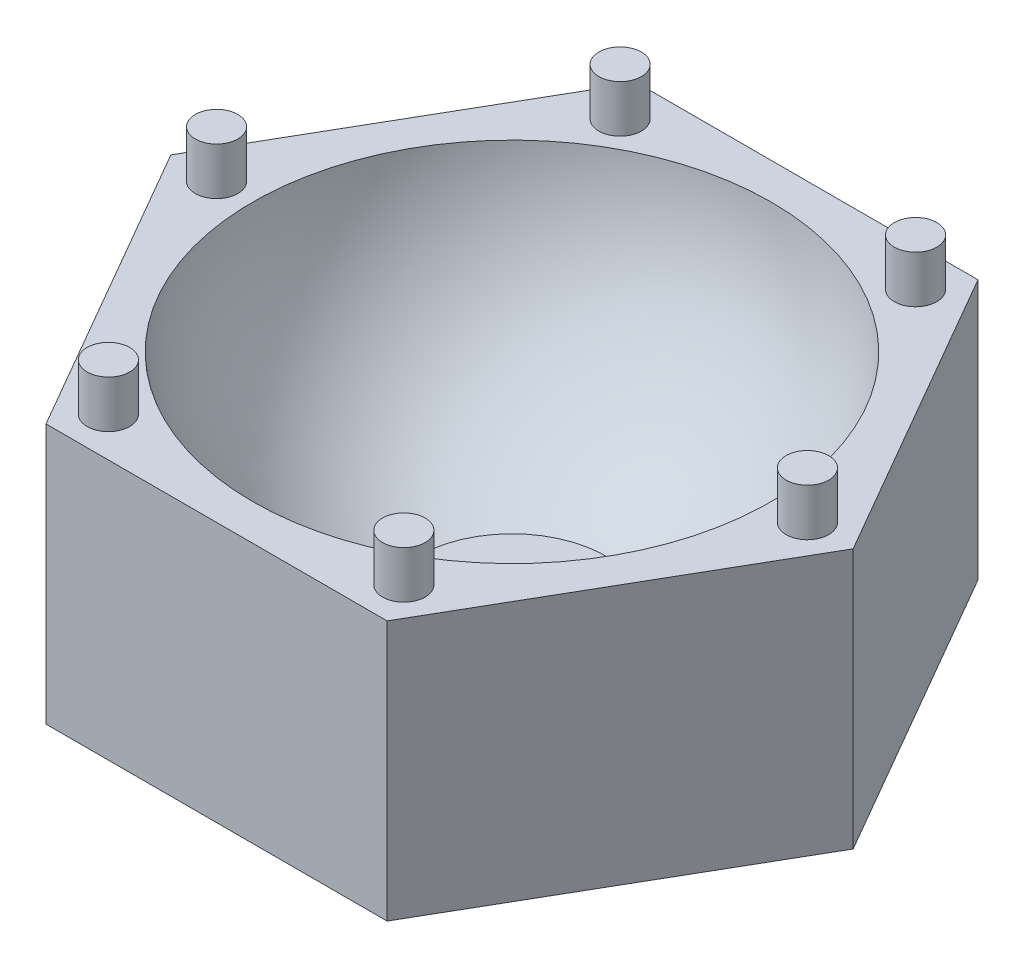
ISO-10303-21;
HEADER;
FILE_DESCRIPTION(('STEP AP214'),'2;1');
FILE_NAME('part.step','',(''),(''),'','','');
FILE_SCHEMA(('AUTOMOTIVE_DESIGN { 1 0 10303 214 1 1 1 1 }'));
ENDSEC;
DATA;
#1=APPLICATION_CONTEXT('core data for automotive mechanical design processes');
#2=APPLICATION_PROTOCOL_DEFINITION('international standard','automotive_design',2000,#1);
#3=PRODUCT_CONTEXT('',#1,'mechanical');
#4=PRODUCT('Part','Part','',(#3));
#5=PRODUCT_RELATED_PRODUCT_CATEGORY('part','',(#4));
#6=PRODUCT_DEFINITION_FORMATION('','',#4);
#7=PRODUCT_DEFINITION_CONTEXT('part definition',#1,'design');
#8=PRODUCT_DEFINITION('design','',#6,#7);
#9=PRODUCT_DEFINITION_SHAPE('','',#8);
#10=(LENGTH_UNIT() NAMED_UNIT(*) SI_UNIT(.MILLI.,.METRE.));
#11=(NAMED_UNIT(*) PLANE_ANGLE_UNIT() SI_UNIT($,.RADIAN.));
#12=(NAMED_UNIT(*) SI_UNIT($,.STERADIAN.) SOLID_ANGLE_UNIT());
#13=UNCERTAINTY_MEASURE_WITH_UNIT(LENGTH_MEASURE(1.E-05),#10,'distance_accuracy_value','');
#14=(GEOMETRIC_REPRESENTATION_CONTEXT(3) GLOBAL_UNCERTAINTY_ASSIGNED_CONTEXT((#13)) GLOBAL_UNIT_ASSIGNED_CONTEXT((#10,
#11,#12)) REPRESENTATION_CONTEXT('',''));
#15=CARTESIAN_POINT('',(0.,0.,0.));
#16=DIRECTION('',(0.,0.,1.));
#17=DIRECTION('',(1.,0.,0.));
#18=AXIS2_PLACEMENT_3D('',#15,#16,#17);
#19=CARTESIAN_POINT('',(0.,55.,0.));
#20=DIRECTION('',(0.,1.,0.));
#21=DIRECTION('',(0.,0.,1.));
#22=AXIS2_PLACEMENT_3D('',#19,#20,#21);
#23=PLANE('',#22);
#24=CARTESIAN_POINT('',(31.25,55.,-54.1265877365274));
#25=DIRECTION('',(0.,1.,0.));
#26=DIRECTION('',(0.,0.,1.));
#27=AXIS2_PLACEMENT_3D('',#24,#25,#26);
#28=CIRCLE('',#27,4.50000000000001);
#29=CARTESIAN_POINT('',(31.25,55.,-49.6265877365274));
#30=VERTEX_POINT('',#29);
#31=EDGE_CURVE('E236',#30,#30,#28,.T.);
#32=ORIENTED_EDGE('',*,*,#31,.F.);
#33=EDGE_LOOP('',(#32));
#34=FACE_BOUND('',#33,.T.);
#35=CARTESIAN_POINT('',(-31.25,55.,-54.1265877365274));
#36=DIRECTION('',(0.,1.,0.));
#37=DIRECTION('',(0.,0.,1.));
#38=AXIS2_PLACEMENT_3D('',#35,#36,#37);
#39=CIRCLE('',#38,4.50000000000001);
#40=CARTESIAN_POINT('',(-31.25,55.,-49.6265877365274));
#41=VERTEX_POINT('',#40);
#42=EDGE_CURVE('E235',#41,#41,#39,.T.);
#43=ORIENTED_EDGE('',*,*,#42,.F.);
#44=EDGE_LOOP('',(#43));
#45=FACE_BOUND('',#44,.T.);
#46=CARTESIAN_POINT('',(-62.5,55.,0.));
#47=DIRECTION('',(0.,1.,0.));
#48=DIRECTION('',(0.,0.,1.));
#49=AXIS2_PLACEMENT_3D('',#46,#47,#48);
#50=CIRCLE('',#49,4.50000000000001);
#51=CARTESIAN_POINT('',(-62.5,55.,4.50000000000002));
#52=VERTEX_POINT('',#51);
#53=EDGE_CURVE('E245',#52,#52,#50,.T.);
#54=ORIENTED_EDGE('',*,*,#53,.F.);
#55=EDGE_LOOP('',(#54));
#56=FACE_BOUND('',#55,.T.);
#57=CARTESIAN_POINT('',(-31.25,55.,54.1265877365274));
#58=DIRECTION('',(0.,1.,0.));
#59=DIRECTION('',(0.,0.,1.));
#60=AXIS2_PLACEMENT_3D('',#57,#58,#59);
#61=CIRCLE('',#60,4.50000000000002);
#62=CARTESIAN_POINT('',(-31.25,55.,58.6265877365274));
#63=VERTEX_POINT('',#62);
#64=EDGE_CURVE('E250',#63,#63,#61,.T.);
#65=ORIENTED_EDGE('',*,*,#64,.F.);
#66=EDGE_LOOP('',(#65));
#67=FACE_BOUND('',#66,.T.);
#68=CARTESIAN_POINT('',(31.25,55.,54.1265877365274));
#69=DIRECTION('',(0.,1.,0.));
#70=DIRECTION('',(0.,0.,1.));
#71=AXIS2_PLACEMENT_3D('',#68,#69,#70);
#72=CIRCLE('',#71,4.50000000000001);
#73=CARTESIAN_POINT('',(31.25,55.,58.6265877365274));
#74=VERTEX_POINT('',#73);
#75=EDGE_CURVE('E256',#74,#74,#72,.T.);
#76=ORIENTED_EDGE('',*,*,#75,.F.);
#77=EDGE_LOOP('',(#76));
#78=FACE_BOUND('',#77,.T.);
#79=CARTESIAN_POINT('',(62.5,55.,0.));
#80=DIRECTION('',(0.,1.,0.));
#81=DIRECTION('',(0.,0.,1.));
#82=AXIS2_PLACEMENT_3D('',#79,#80,#81);
#83=CIRCLE('',#82,4.5);
#84=CARTESIAN_POINT('',(62.5,55.,4.5));
#85=VERTEX_POINT('',#84);
#86=EDGE_CURVE('E119',#85,#85,#83,.T.);
#87=ORIENTED_EDGE('',*,*,#86,.F.);
#88=EDGE_LOOP('',(#87));
#89=FACE_BOUND('',#88,.T.);
#90=DIRECTION('',(1.,0.,0.));
#91=VECTOR('',#90,1.);
#92=CARTESIAN_POINT('',(-36.0843918243516,55.,62.5));
#93=LINE('',#92,#91);
#94=CARTESIAN_POINT('',(-36.0843918243516,55.,62.5));
#95=VERTEX_POINT('',#94);
#96=CARTESIAN_POINT('',(36.0843918243516,55.,62.5));
#97=VERTEX_POINT('',#96);
#98=EDGE_CURVE('E94',#95,#97,#93,.T.);
#99=ORIENTED_EDGE('',*,*,#98,.T.);
#100=DIRECTION('',(0.499999999999999,0.,-0.866025403784439));
#101=VECTOR('',#100,1.);
#102=CARTESIAN_POINT('',(36.0843918243516,55.,62.5));
#103=LINE('',#102,#101);
#104=CARTESIAN_POINT('',(72.1687836487032,55.,0.));
#105=VERTEX_POINT('',#104);
#106=EDGE_CURVE('E102',#97,#105,#103,.T.);
#107=ORIENTED_EDGE('',*,*,#106,.T.);
#108=DIRECTION('',(-0.5,0.,-0.866025403784438));
#109=VECTOR('',#108,1.);
#110=CARTESIAN_POINT('',(72.1687836487032,55.,0.));
#111=LINE('',#110,#109);
#112=CARTESIAN_POINT('',(36.0843918243516,55.,-62.5));
#113=VERTEX_POINT('',#112);
#114=EDGE_CURVE('E107',#105,#113,#111,.T.);
#115=ORIENTED_EDGE('',*,*,#114,.T.);
#116=DIRECTION('',(-1.,0.,0.));
#117=VECTOR('',#116,1.);
#118=CARTESIAN_POINT('',(36.0843918243516,55.,-62.5));
#119=LINE('',#118,#117);
#120=CARTESIAN_POINT('',(-36.0843918243516,55.,-62.5));
#121=VERTEX_POINT('',#120);
#122=EDGE_CURVE('E151',#113,#121,#119,.T.);
#123=ORIENTED_EDGE('',*,*,#122,.T.);
#124=DIRECTION('',(-0.499999999999999,0.,0.866025403784439));
#125=VECTOR('',#124,1.);
#126=CARTESIAN_POINT('',(-36.0843918243516,55.,-62.5));
#127=LINE('',#126,#125);
#128=CARTESIAN_POINT('',(-72.1687836487032,55.,0.));
#129=VERTEX_POINT('',#128);
#130=EDGE_CURVE('E116',#121,#129,#127,.T.);
#131=ORIENTED_EDGE('',*,*,#130,.T.);
#132=DIRECTION('',(0.5,0.,0.866025403784439));
#133=VECTOR('',#132,1.);
#134=CARTESIAN_POINT('',(-72.1687836487032,55.,0.));
#135=LINE('',#134,#133);
#136=EDGE_CURVE('E113',#129,#95,#135,.T.);
#137=ORIENTED_EDGE('',*,*,#136,.T.);
#138=EDGE_LOOP('',(#99,#107,#115,#123,#131,#137));
#139=FACE_BOUND('',#138,.T.);
#140=CARTESIAN_POINT('',(0.,55.,0.));
#141=DIRECTION('',(0.,1.,0.));
#142=DIRECTION('',(0.,0.,1.));
#143=AXIS2_PLACEMENT_3D('',#140,#141,#142);
#144=CIRCLE('',#143,54.8709661048334);
#145=CARTESIAN_POINT('',(0.,55.,54.8709661048334));
#146=VERTEX_POINT('',#145);
#147=EDGE_CURVE('E106',#146,#146,#144,.T.);
#148=ORIENTED_EDGE('',*,*,#147,.F.);
#149=EDGE_LOOP('',(#148));
#150=FACE_BOUND('',#149,.T.);
#151=ADVANCED_FACE('F36',(#34,#45,#56,#67,#78,#89,#139,#150),#23,.T.);
#152=CARTESIAN_POINT('',(0.,7.53049234040404,0.));
#153=DIRECTION('',(0.,1.,0.));
#154=DIRECTION('',(0.,0.,1.));
#155=AXIS2_PLACEMENT_3D('',#152,#153,#154);
#156=PLANE('',#155);
#157=CARTESIAN_POINT('',(0.,7.53049234040402,0.));
#158=DIRECTION('',(0.,1.,0.));
#159=DIRECTION('',(0.,0.,1.));
#160=AXIS2_PLACEMENT_3D('',#157,#158,#159);
#161=CIRCLE('',#160,20.);
#162=CARTESIAN_POINT('',(0.,7.53049234040402,20.));
#163=VERTEX_POINT('',#162);
#164=EDGE_CURVE('E11',#163,#163,#161,.T.);
#165=ORIENTED_EDGE('',*,*,#164,.T.);
#166=EDGE_LOOP('',(#165));
#167=FACE_BOUND('',#166,.T.);
#168=ADVANCED_FACE('F167',(#167),#156,.T.);
#169=CARTESIAN_POINT('',(0.,58.765246170202,0.));
#170=DIRECTION('',(0.,1.,0.));
#171=DIRECTION('',(0.,0.,-1.));
#172=AXIS2_PLACEMENT_3D('',#169,#170,#171);
#173=SPHERICAL_SURFACE('',#172,55.);
#174=ORIENTED_EDGE('',*,*,#164,.F.);
#175=EDGE_LOOP('',(#174));
#176=FACE_BOUND('',#175,.T.);
#177=ORIENTED_EDGE('',*,*,#147,.T.);
#178=EDGE_LOOP('',(#177));
#179=FACE_BOUND('',#178,.T.);
#180=ADVANCED_FACE('F169',(#176,#179),#173,.F.);
#181=CARTESIAN_POINT('',(36.0843918243516,110.,62.5));
#182=DIRECTION('',(-0.866025403784439,0.,-0.499999999999999));
#183=DIRECTION('',(-0.499999999999999,0.,0.866025403784439));
#184=AXIS2_PLACEMENT_3D('',#181,#182,#183);
#185=PLANE('',#184);
#186=ORIENTED_EDGE('',*,*,#106,.F.);
#187=DIRECTION('',(0.,-1.,0.));
#188=VECTOR('',#187,1.);
#189=CARTESIAN_POINT('',(36.0843918243516,110.,62.5));
#190=LINE('',#189,#188);
#191=CARTESIAN_POINT('',(36.0843918243516,0.,62.5));
#192=VERTEX_POINT('',#191);
#193=EDGE_CURVE('E40',#97,#192,#190,.T.);
#194=ORIENTED_EDGE('',*,*,#193,.T.);
#195=DIRECTION('',(0.499999999999999,0.,-0.866025403784439));
#196=VECTOR('',#195,1.);
#197=CARTESIAN_POINT('',(36.0843918243516,0.,62.5));
#198=LINE('',#197,#196);
#199=CARTESIAN_POINT('',(72.1687836487032,0.,0.));
#200=VERTEX_POINT('',#199);
#201=EDGE_CURVE('E45',#192,#200,#198,.T.);
#202=ORIENTED_EDGE('',*,*,#201,.T.);
#203=DIRECTION('',(0.,-1.,0.));
#204=VECTOR('',#203,1.);
#205=CARTESIAN_POINT('',(72.1687836487032,110.,0.));
#206=LINE('',#205,#204);
#207=EDGE_CURVE('E53',#105,#200,#206,.T.);
#208=ORIENTED_EDGE('',*,*,#207,.F.);
#209=EDGE_LOOP('',(#186,#194,#202,#208));
#210=FACE_BOUND('',#209,.T.);
#211=ADVANCED_FACE('F103',(#210),#185,.F.);
#212=CARTESIAN_POINT('',(72.1687836487032,110.,0.));
#213=DIRECTION('',(-0.866025403784438,0.,0.5));
#214=DIRECTION('',(0.5,0.,0.866025403784438));
#215=AXIS2_PLACEMENT_3D('',#212,#213,#214);
#216=PLANE('',#215);
#217=ORIENTED_EDGE('',*,*,#114,.F.);
#218=ORIENTED_EDGE('',*,*,#207,.T.);
#219=DIRECTION('',(-0.5,0.,-0.866025403784438));
#220=VECTOR('',#219,1.);
#221=CARTESIAN_POINT('',(72.1687836487032,0.,0.));
#222=LINE('',#221,#220);
#223=CARTESIAN_POINT('',(36.0843918243516,0.,-62.5));
#224=VERTEX_POINT('',#223);
#225=EDGE_CURVE('E145',#200,#224,#222,.T.);
#226=ORIENTED_EDGE('',*,*,#225,.T.);
#227=DIRECTION('',(0.,-1.,0.));
#228=VECTOR('',#227,1.);
#229=CARTESIAN_POINT('',(36.0843918243516,110.,-62.5));
#230=LINE('',#229,#228);
#231=EDGE_CURVE('E61',#113,#224,#230,.T.);
#232=ORIENTED_EDGE('',*,*,#231,.F.);
#233=EDGE_LOOP('',(#217,#218,#226,#232));
#234=FACE_BOUND('',#233,.T.);
#235=ADVANCED_FACE('F159',(#234),#216,.F.);
#236=CARTESIAN_POINT('',(36.0843918243516,110.,-62.5));
#237=DIRECTION('',(0.,0.,1.));
#238=DIRECTION('',(1.,0.,0.));
#239=AXIS2_PLACEMENT_3D('',#236,#237,#238);
#240=PLANE('',#239);
#241=ORIENTED_EDGE('',*,*,#122,.F.);
#242=ORIENTED_EDGE('',*,*,#231,.T.);
#243=DIRECTION('',(-1.,0.,0.));
#244=VECTOR('',#243,1.);
#245=CARTESIAN_POINT('',(36.0843918243516,0.,-62.5));
#246=LINE('',#245,#244);
#247=CARTESIAN_POINT('',(-36.0843918243516,0.,-62.5));
#248=VERTEX_POINT('',#247);
#249=EDGE_CURVE('E143',#224,#248,#246,.T.);
#250=ORIENTED_EDGE('',*,*,#249,.T.);
#251=DIRECTION('',(0.,-1.,0.));
#252=VECTOR('',#251,1.);
#253=CARTESIAN_POINT('',(-36.0843918243516,110.,-62.5));
#254=LINE('',#253,#252);
#255=EDGE_CURVE('E125',#121,#248,#254,.T.);
#256=ORIENTED_EDGE('',*,*,#255,.F.);
#257=EDGE_LOOP('',(#241,#242,#250,#256));
#258=FACE_BOUND('',#257,.T.);
#259=ADVANCED_FACE('F157',(#258),#240,.F.);
#260=CARTESIAN_POINT('',(-36.0843918243516,110.,-62.5));
#261=DIRECTION('',(0.866025403784439,0.,0.499999999999999));
#262=DIRECTION('',(0.499999999999999,0.,-0.866025403784439));
#263=AXIS2_PLACEMENT_3D('',#260,#261,#262);
#264=PLANE('',#263);
#265=ORIENTED_EDGE('',*,*,#130,.F.);
#266=ORIENTED_EDGE('',*,*,#255,.T.);
#267=DIRECTION('',(-0.499999999999999,0.,0.866025403784439));
#268=VECTOR('',#267,1.);
#269=CARTESIAN_POINT('',(-36.0843918243516,0.,-62.5));
#270=LINE('',#269,#268);
#271=CARTESIAN_POINT('',(-72.1687836487032,0.,0.));
#272=VERTEX_POINT('',#271);
#273=EDGE_CURVE('E136',#248,#272,#270,.T.);
#274=ORIENTED_EDGE('',*,*,#273,.T.);
#275=DIRECTION('',(0.,-1.,0.));
#276=VECTOR('',#275,1.);
#277=CARTESIAN_POINT('',(-72.1687836487032,110.,0.));
#278=LINE('',#277,#276);
#279=EDGE_CURVE('E127',#129,#272,#278,.T.);
#280=ORIENTED_EDGE('',*,*,#279,.F.);
#281=EDGE_LOOP('',(#265,#266,#274,#280));
#282=FACE_BOUND('',#281,.T.);
#283=ADVANCED_FACE('F155',(#282),#264,.F.);
#284=CARTESIAN_POINT('',(-72.1687836487032,110.,0.));
#285=DIRECTION('',(0.866025403784439,0.,-0.5));
#286=DIRECTION('',(-0.5,0.,-0.866025403784439));
#287=AXIS2_PLACEMENT_3D('',#284,#285,#286);
#288=PLANE('',#287);
#289=ORIENTED_EDGE('',*,*,#136,.F.);
#290=ORIENTED_EDGE('',*,*,#279,.T.);
#291=DIRECTION('',(0.5,0.,0.866025403784438));
#292=VECTOR('',#291,1.);
#293=CARTESIAN_POINT('',(-72.1687836487032,0.,0.));
#294=LINE('',#293,#292);
#295=CARTESIAN_POINT('',(-36.0843918243516,0.,62.5));
#296=VERTEX_POINT('',#295);
#297=EDGE_CURVE('E131',#272,#296,#294,.T.);
#298=ORIENTED_EDGE('',*,*,#297,.T.);
#299=DIRECTION('',(0.,-1.,0.));
#300=VECTOR('',#299,1.);
#301=CARTESIAN_POINT('',(-36.0843918243516,110.,62.5));
#302=LINE('',#301,#300);
#303=EDGE_CURVE('E100',#95,#296,#302,.T.);
#304=ORIENTED_EDGE('',*,*,#303,.F.);
#305=EDGE_LOOP('',(#289,#290,#298,#304));
#306=FACE_BOUND('',#305,.T.);
#307=ADVANCED_FACE('F132',(#306),#288,.F.);
#308=CARTESIAN_POINT('',(-36.0843918243516,110.,62.5));
#309=DIRECTION('',(0.,0.,-1.));
#310=DIRECTION('',(-1.,0.,0.));
#311=AXIS2_PLACEMENT_3D('',#308,#309,#310);
#312=PLANE('',#311);
#313=ORIENTED_EDGE('',*,*,#98,.F.);
#314=ORIENTED_EDGE('',*,*,#303,.T.);
#315=DIRECTION('',(1.,0.,0.));
#316=VECTOR('',#315,1.);
#317=CARTESIAN_POINT('',(-36.0843918243516,0.,62.5));
#318=LINE('',#317,#316);
#319=EDGE_CURVE('E96',#296,#192,#318,.T.);
#320=ORIENTED_EDGE('',*,*,#319,.T.);
#321=ORIENTED_EDGE('',*,*,#193,.F.);
#322=EDGE_LOOP('',(#313,#314,#320,#321));
#323=FACE_BOUND('',#322,.T.);
#324=ADVANCED_FACE('F38',(#323),#312,.F.);
#325=CARTESIAN_POINT('',(0.,0.,0.));
#326=DIRECTION('',(0.,1.,0.));
#327=DIRECTION('',(0.,0.,1.));
#328=AXIS2_PLACEMENT_3D('',#325,#326,#327);
#329=PLANE('',#328);
#330=ORIENTED_EDGE('',*,*,#201,.F.);
#331=ORIENTED_EDGE('',*,*,#319,.F.);
#332=ORIENTED_EDGE('',*,*,#297,.F.);
#333=ORIENTED_EDGE('',*,*,#273,.F.);
#334=ORIENTED_EDGE('',*,*,#249,.F.);
#335=ORIENTED_EDGE('',*,*,#225,.F.);
#336=EDGE_LOOP('',(#330,#331,#332,#333,#334,#335));
#337=FACE_BOUND('',#336,.T.);
#338=ADVANCED_FACE('F138',(#337),#329,.F.);
#339=CARTESIAN_POINT('',(62.5,65.,0.));
#340=DIRECTION('',(0.,-1.,0.));
#341=DIRECTION('',(0.,0.,-1.));
#342=AXIS2_PLACEMENT_3D('',#339,#340,#341);
#343=CYLINDRICAL_SURFACE('',#342,4.5);
#344=CARTESIAN_POINT('',(62.5,65.,0.));
#345=DIRECTION('',(0.,1.,0.));
#346=DIRECTION('',(0.,0.,1.));
#347=AXIS2_PLACEMENT_3D('',#344,#345,#346);
#348=CIRCLE('',#347,4.5);
#349=CARTESIAN_POINT('',(62.5,65.,4.5));
#350=VERTEX_POINT('',#349);
#351=EDGE_CURVE('E114',#350,#350,#348,.T.);
#352=ORIENTED_EDGE('',*,*,#351,.F.);
#353=EDGE_LOOP('',(#352));
#354=FACE_BOUND('',#353,.T.);
#355=ORIENTED_EDGE('',*,*,#86,.T.);
#356=EDGE_LOOP('',(#355));
#357=FACE_BOUND('',#356,.T.);
#358=ADVANCED_FACE('F180',(#354,#357),#343,.T.);
#359=CARTESIAN_POINT('',(62.5,65.,0.));
#360=DIRECTION('',(0.,1.,0.));
#361=DIRECTION('',(0.,0.,1.));
#362=AXIS2_PLACEMENT_3D('',#359,#360,#361);
#363=PLANE('',#362);
#364=ORIENTED_EDGE('',*,*,#351,.T.);
#365=EDGE_LOOP('',(#364));
#366=FACE_BOUND('',#365,.T.);
#367=ADVANCED_FACE('F186',(#366),#363,.T.);
#368=CARTESIAN_POINT('',(31.25,65.,54.1265877365274));
#369=DIRECTION('',(0.,-1.,0.));
#370=DIRECTION('',(0.,0.,-1.));
#371=AXIS2_PLACEMENT_3D('',#368,#369,#370);
#372=CYLINDRICAL_SURFACE('',#371,4.50000000000001);
#373=CARTESIAN_POINT('',(31.25,65.,54.1265877365274));
#374=DIRECTION('',(0.,1.,0.));
#375=DIRECTION('',(0.,0.,1.));
#376=AXIS2_PLACEMENT_3D('',#373,#374,#375);
#377=CIRCLE('',#376,4.50000000000001);
#378=CARTESIAN_POINT('',(31.25,65.,58.6265877365274));
#379=VERTEX_POINT('',#378);
#380=EDGE_CURVE('E259',#379,#379,#377,.T.);
#381=ORIENTED_EDGE('',*,*,#380,.F.);
#382=EDGE_LOOP('',(#381));
#383=FACE_BOUND('',#382,.T.);
#384=ORIENTED_EDGE('',*,*,#75,.T.);
#385=EDGE_LOOP('',(#384));
#386=FACE_BOUND('',#385,.T.);
#387=ADVANCED_FACE('F190',(#383,#386),#372,.T.);
#388=CARTESIAN_POINT('',(31.25,65.,54.1265877365274));
#389=DIRECTION('',(0.,1.,0.));
#390=DIRECTION('',(0.,0.,1.));
#391=AXIS2_PLACEMENT_3D('',#388,#389,#390);
#392=PLANE('',#391);
#393=ORIENTED_EDGE('',*,*,#380,.T.);
#394=EDGE_LOOP('',(#393));
#395=FACE_BOUND('',#394,.T.);
#396=ADVANCED_FACE('F194',(#395),#392,.T.);
#397=CARTESIAN_POINT('',(-31.25,65.,54.1265877365274));
#398=DIRECTION('',(0.,-1.,0.));
#399=DIRECTION('',(0.,0.,-1.));
#400=AXIS2_PLACEMENT_3D('',#397,#398,#399);
#401=CYLINDRICAL_SURFACE('',#400,4.50000000000002);
#402=CARTESIAN_POINT('',(-31.25,65.,54.1265877365274));
#403=DIRECTION('',(0.,1.,0.));
#404=DIRECTION('',(0.,0.,1.));
#405=AXIS2_PLACEMENT_3D('',#402,#403,#404);
#406=CIRCLE('',#405,4.50000000000002);
#407=CARTESIAN_POINT('',(-31.25,65.,58.6265877365274));
#408=VERTEX_POINT('',#407);
#409=EDGE_CURVE('E253',#408,#408,#406,.T.);
#410=ORIENTED_EDGE('',*,*,#409,.F.);
#411=EDGE_LOOP('',(#410));
#412=FACE_BOUND('',#411,.T.);
#413=ORIENTED_EDGE('',*,*,#64,.T.);
#414=EDGE_LOOP('',(#413));
#415=FACE_BOUND('',#414,.T.);
#416=ADVANCED_FACE('F198',(#412,#415),#401,.T.);
#417=CARTESIAN_POINT('',(-31.25,65.,54.1265877365274));
#418=DIRECTION('',(0.,1.,0.));
#419=DIRECTION('',(0.,0.,1.));
#420=AXIS2_PLACEMENT_3D('',#417,#418,#419);
#421=PLANE('',#420);
#422=ORIENTED_EDGE('',*,*,#409,.T.);
#423=EDGE_LOOP('',(#422));
#424=FACE_BOUND('',#423,.T.);
#425=ADVANCED_FACE('F202',(#424),#421,.T.);
#426=CARTESIAN_POINT('',(-62.5,65.,0.));
#427=DIRECTION('',(0.,-1.,0.));
#428=DIRECTION('',(0.,0.,-1.));
#429=AXIS2_PLACEMENT_3D('',#426,#427,#428);
#430=CYLINDRICAL_SURFACE('',#429,4.50000000000001);
#431=CARTESIAN_POINT('',(-62.5,65.,0.));
#432=DIRECTION('',(0.,1.,0.));
#433=DIRECTION('',(0.,0.,1.));
#434=AXIS2_PLACEMENT_3D('',#431,#432,#433);
#435=CIRCLE('',#434,4.50000000000001);
#436=CARTESIAN_POINT('',(-62.5,65.,4.50000000000002));
#437=VERTEX_POINT('',#436);
#438=EDGE_CURVE('E247',#437,#437,#435,.T.);
#439=ORIENTED_EDGE('',*,*,#438,.F.);
#440=EDGE_LOOP('',(#439));
#441=FACE_BOUND('',#440,.T.);
#442=ORIENTED_EDGE('',*,*,#53,.T.);
#443=EDGE_LOOP('',(#442));
#444=FACE_BOUND('',#443,.T.);
#445=ADVANCED_FACE('F206',(#441,#444),#430,.T.);
#446=CARTESIAN_POINT('',(-62.5,65.,0.));
#447=DIRECTION('',(0.,1.,0.));
#448=DIRECTION('',(0.,0.,1.));
#449=AXIS2_PLACEMENT_3D('',#446,#447,#448);
#450=PLANE('',#449);
#451=ORIENTED_EDGE('',*,*,#438,.T.);
#452=EDGE_LOOP('',(#451));
#453=FACE_BOUND('',#452,.T.);
#454=ADVANCED_FACE('F210',(#453),#450,.T.);
#455=CARTESIAN_POINT('',(-31.25,65.,-54.1265877365274));
#456=DIRECTION('',(0.,-1.,0.));
#457=DIRECTION('',(0.,0.,-1.));
#458=AXIS2_PLACEMENT_3D('',#455,#456,#457);
#459=CYLINDRICAL_SURFACE('',#458,4.50000000000001);
#460=CARTESIAN_POINT('',(-31.25,65.,-54.1265877365274));
#461=DIRECTION('',(0.,1.,0.));
#462=DIRECTION('',(0.,0.,1.));
#463=AXIS2_PLACEMENT_3D('',#460,#461,#462);
#464=CIRCLE('',#463,4.50000000000001);
#465=CARTESIAN_POINT('',(-31.25,65.,-49.6265877365274));
#466=VERTEX_POINT('',#465);
#467=EDGE_CURVE('E239',#466,#466,#464,.T.);
#468=ORIENTED_EDGE('',*,*,#467,.F.);
#469=EDGE_LOOP('',(#468));
#470=FACE_BOUND('',#469,.T.);
#471=ORIENTED_EDGE('',*,*,#42,.T.);
#472=EDGE_LOOP('',(#471));
#473=FACE_BOUND('',#472,.T.);
#474=ADVANCED_FACE('F214',(#470,#473),#459,.T.);
#475=CARTESIAN_POINT('',(-31.25,65.,-54.1265877365274));
#476=DIRECTION('',(0.,1.,0.));
#477=DIRECTION('',(0.,0.,1.));
#478=AXIS2_PLACEMENT_3D('',#475,#476,#477);
#479=PLANE('',#478);
#480=ORIENTED_EDGE('',*,*,#467,.T.);
#481=EDGE_LOOP('',(#480));
#482=FACE_BOUND('',#481,.T.);
#483=ADVANCED_FACE('F218',(#482),#479,.T.);
#484=CARTESIAN_POINT('',(31.25,65.,-54.1265877365274));
#485=DIRECTION('',(0.,-1.,0.));
#486=DIRECTION('',(0.,0.,-1.));
#487=AXIS2_PLACEMENT_3D('',#484,#485,#486);
#488=CYLINDRICAL_SURFACE('',#487,4.50000000000001);
#489=CARTESIAN_POINT('',(31.25,65.,-54.1265877365274));
#490=DIRECTION('',(0.,1.,0.));
#491=DIRECTION('',(0.,0.,1.));
#492=AXIS2_PLACEMENT_3D('',#489,#490,#491);
#493=CIRCLE('',#492,4.50000000000001);
#494=CARTESIAN_POINT('',(31.25,65.,-49.6265877365274));
#495=VERTEX_POINT('',#494);
#496=EDGE_CURVE('E234',#495,#495,#493,.T.);
#497=ORIENTED_EDGE('',*,*,#496,.F.);
#498=EDGE_LOOP('',(#497));
#499=FACE_BOUND('',#498,.T.);
#500=ORIENTED_EDGE('',*,*,#31,.T.);
#501=EDGE_LOOP('',(#500));
#502=FACE_BOUND('',#501,.T.);
#503=ADVANCED_FACE('F222',(#499,#502),#488,.T.);
#504=CARTESIAN_POINT('',(31.25,65.,-54.1265877365274));
#505=DIRECTION('',(0.,1.,0.));
#506=DIRECTION('',(0.,0.,1.));
#507=AXIS2_PLACEMENT_3D('',#504,#505,#506);
#508=PLANE('',#507);
#509=ORIENTED_EDGE('',*,*,#496,.T.);
#510=EDGE_LOOP('',(#509));
#511=FACE_BOUND('',#510,.T.);
#512=ADVANCED_FACE('F226',(#511),#508,.T.);
#513=CLOSED_SHELL('',(#151,#168,#180,#211,#235,#259,#283,#307,#324,#338,#358,#367,#387,#396,
#416,#425,#445,#454,#474,#483,#503,#512));
#514=MANIFOLD_SOLID_BREP('B2',#513);
#515=ADVANCED_BREP_SHAPE_REPRESENTATION('',(#18,#514),#14);
#516=SHAPE_DEFINITION_REPRESENTATION(#9,#515);
ENDSEC;
END-ISO-10303-21;
